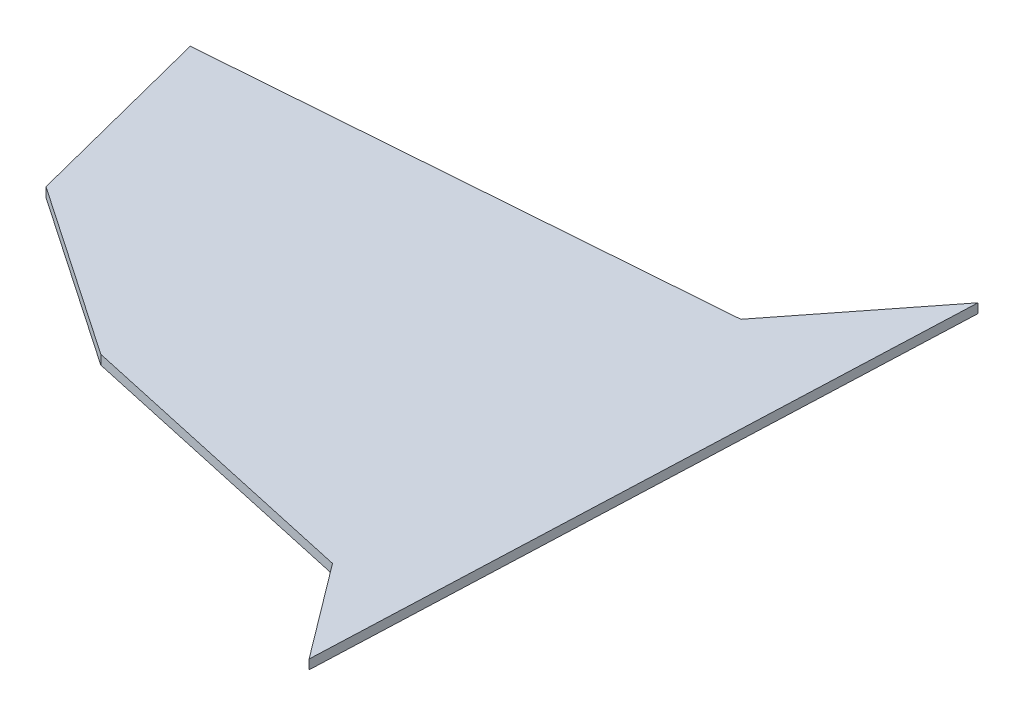
ISO-10303-21;
HEADER;
FILE_DESCRIPTION(('STEP AP214'),'2;1');
FILE_NAME('part.step','',(''),(''),'','','');
FILE_SCHEMA(('AUTOMOTIVE_DESIGN { 1 0 10303 214 1 1 1 1 }'));
ENDSEC;
DATA;
#1=APPLICATION_CONTEXT('core data for automotive mechanical design processes');
#2=APPLICATION_PROTOCOL_DEFINITION('international standard','automotive_design',2000,#1);
#3=PRODUCT_CONTEXT('',#1,'mechanical');
#4=PRODUCT('Part','Part','',(#3));
#5=PRODUCT_RELATED_PRODUCT_CATEGORY('part','',(#4));
#6=PRODUCT_DEFINITION_FORMATION('','',#4);
#7=PRODUCT_DEFINITION_CONTEXT('part definition',#1,'design');
#8=PRODUCT_DEFINITION('design','',#6,#7);
#9=PRODUCT_DEFINITION_SHAPE('','',#8);
#10=(LENGTH_UNIT() NAMED_UNIT(*) SI_UNIT(.MILLI.,.METRE.));
#11=(NAMED_UNIT(*) PLANE_ANGLE_UNIT() SI_UNIT($,.RADIAN.));
#12=(NAMED_UNIT(*) SI_UNIT($,.STERADIAN.) SOLID_ANGLE_UNIT());
#13=UNCERTAINTY_MEASURE_WITH_UNIT(LENGTH_MEASURE(1.E-05),#10,'distance_accuracy_value','');
#14=(GEOMETRIC_REPRESENTATION_CONTEXT(3) GLOBAL_UNCERTAINTY_ASSIGNED_CONTEXT((#13)) GLOBAL_UNIT_ASSIGNED_CONTEXT((#10,
#11,#12)) REPRESENTATION_CONTEXT('',''));
#15=CARTESIAN_POINT('',(0.,0.,0.));
#16=DIRECTION('',(0.,0.,1.));
#17=DIRECTION('',(1.,0.,0.));
#18=AXIS2_PLACEMENT_3D('',#15,#16,#17);
#19=CARTESIAN_POINT('',(115.204742489749,2.,59.1333729022609));
#20=DIRECTION('',(-0.999185842205052,0.,-0.0403441784769609));
#21=DIRECTION('',(-0.0403441784769609,0.,0.999185842205052));
#22=AXIS2_PLACEMENT_3D('',#19,#20,#21);
#23=PLANE('',#22);
#24=DIRECTION('',(0.0403441784769609,0.,-0.999185842205052));
#25=VECTOR('',#24,1.);
#26=CARTESIAN_POINT('',(115.204742489749,0.,59.1333729022609));
#27=LINE('',#26,#25);
#28=CARTESIAN_POINT('',(115.204742489749,0.,59.1333729022609));
#29=VERTEX_POINT('',#28);
#30=CARTESIAN_POINT('',(120.737356272689,0.,-77.8903457851641));
#31=VERTEX_POINT('',#30);
#32=EDGE_CURVE('E134',#29,#31,#27,.T.);
#33=ORIENTED_EDGE('',*,*,#32,.T.);
#34=DIRECTION('',(0.,-1.,0.));
#35=VECTOR('',#34,1.);
#36=CARTESIAN_POINT('',(120.737356272689,2.,-77.8903457851641));
#37=LINE('',#36,#35);
#38=CARTESIAN_POINT('',(120.737356272689,2.,-77.8903457851641));
#39=VERTEX_POINT('',#38);
#40=EDGE_CURVE('E11',#39,#31,#37,.T.);
#41=ORIENTED_EDGE('',*,*,#40,.F.);
#42=DIRECTION('',(0.0403441784769609,0.,-0.999185842205052));
#43=VECTOR('',#42,1.);
#44=CARTESIAN_POINT('',(115.204742489749,2.,59.1333729022609));
#45=LINE('',#44,#43);
#46=CARTESIAN_POINT('',(115.204742489749,2.,59.1333729022609));
#47=VERTEX_POINT('',#46);
#48=EDGE_CURVE('E153',#47,#39,#45,.T.);
#49=ORIENTED_EDGE('',*,*,#48,.F.);
#50=DIRECTION('',(0.,-1.,0.));
#51=VECTOR('',#50,1.);
#52=CARTESIAN_POINT('',(115.204742489749,2.,59.1333729022609));
#53=LINE('',#52,#51);
#54=EDGE_CURVE('E130',#47,#29,#53,.T.);
#55=ORIENTED_EDGE('',*,*,#54,.T.);
#56=EDGE_LOOP('',(#33,#41,#49,#55));
#57=FACE_BOUND('',#56,.T.);
#58=ADVANCED_FACE('F39',(#57),#23,.F.);
#59=CARTESIAN_POINT('',(120.737356272689,2.,-77.8903457851641));
#60=DIRECTION('',(0.786634461049331,0.,0.617419002533634));
#61=DIRECTION('',(0.617419002533634,0.,-0.786634461049331));
#62=AXIS2_PLACEMENT_3D('',#59,#60,#61);
#63=PLANE('',#62);
#64=DIRECTION('',(-0.617419002533634,0.,0.786634461049331));
#65=VECTOR('',#64,1.);
#66=CARTESIAN_POINT('',(120.737356272689,0.,-77.8903457851641));
#67=LINE('',#66,#65);
#68=CARTESIAN_POINT('',(98.5111559376508,0.,-49.5726311538025));
#69=VERTEX_POINT('',#68);
#70=EDGE_CURVE('E138',#31,#69,#67,.T.);
#71=ORIENTED_EDGE('',*,*,#70,.T.);
#72=DIRECTION('',(0.,-1.,0.));
#73=VECTOR('',#72,1.);
#74=CARTESIAN_POINT('',(98.5111559376508,2.,-49.5726311538025));
#75=LINE('',#74,#73);
#76=CARTESIAN_POINT('',(98.5111559376508,2.,-49.5726311538025));
#77=VERTEX_POINT('',#76);
#78=EDGE_CURVE('E48',#77,#69,#75,.T.);
#79=ORIENTED_EDGE('',*,*,#78,.F.);
#80=DIRECTION('',(-0.617419002533634,0.,0.786634461049331));
#81=VECTOR('',#80,1.);
#82=CARTESIAN_POINT('',(120.737356272689,2.,-77.8903457851641));
#83=LINE('',#82,#81);
#84=EDGE_CURVE('E96',#39,#77,#83,.T.);
#85=ORIENTED_EDGE('',*,*,#84,.F.);
#86=ORIENTED_EDGE('',*,*,#40,.T.);
#87=EDGE_LOOP('',(#71,#79,#85,#86));
#88=FACE_BOUND('',#87,.T.);
#89=ADVANCED_FACE('F187',(#88),#63,.F.);
#90=CARTESIAN_POINT('',(98.5111559376508,2.,-49.5726311538025));
#91=DIRECTION('',(0.0755543985712088,0.,0.997141681435764));
#92=DIRECTION('',(0.997141681435764,0.,-0.0755543985712088));
#93=AXIS2_PLACEMENT_3D('',#90,#91,#92);
#94=PLANE('',#93);
#95=DIRECTION('',(-0.997141681435764,0.,0.0755543985712088));
#96=VECTOR('',#95,1.);
#97=CARTESIAN_POINT('',(98.5111559376508,0.,-49.5726311538025));
#98=LINE('',#97,#96);
#99=CARTESIAN_POINT('',(-10.5666550321741,0.,-41.3076989393326));
#100=VERTEX_POINT('',#99);
#101=EDGE_CURVE('E141',#69,#100,#98,.T.);
#102=ORIENTED_EDGE('',*,*,#101,.T.);
#103=DIRECTION('',(0.,-1.,0.));
#104=VECTOR('',#103,1.);
#105=CARTESIAN_POINT('',(-10.5666550321741,2.,-41.3076989393326));
#106=LINE('',#105,#104);
#107=CARTESIAN_POINT('',(-10.5666550321741,2.,-41.3076989393326));
#108=VERTEX_POINT('',#107);
#109=EDGE_CURVE('E160',#108,#100,#106,.T.);
#110=ORIENTED_EDGE('',*,*,#109,.F.);
#111=DIRECTION('',(-0.997141681435764,0.,0.0755543985712088));
#112=VECTOR('',#111,1.);
#113=CARTESIAN_POINT('',(98.5111559376508,2.,-49.5726311538025));
#114=LINE('',#113,#112);
#115=EDGE_CURVE('E170',#77,#108,#114,.T.);
#116=ORIENTED_EDGE('',*,*,#115,.F.);
#117=ORIENTED_EDGE('',*,*,#78,.T.);
#118=EDGE_LOOP('',(#102,#110,#116,#117));
#119=FACE_BOUND('',#118,.T.);
#120=ADVANCED_FACE('F168',(#119),#94,.F.);
#121=CARTESIAN_POINT('',(-10.5666550321741,2.,-41.3076989393326));
#122=DIRECTION('',(0.968805130027758,0.,-0.247823768093175));
#123=DIRECTION('',(-0.247823768093175,0.,-0.968805130027758));
#124=AXIS2_PLACEMENT_3D('',#121,#122,#123);
#125=PLANE('',#124);
#126=DIRECTION('',(0.247823768093175,0.,0.968805130027757));
#127=VECTOR('',#126,1.);
#128=CARTESIAN_POINT('',(-10.5666550321741,0.,-41.3076989393326));
#129=LINE('',#128,#127);
#130=CARTESIAN_POINT('',(0.,0.,0.));
#131=VERTEX_POINT('',#130);
#132=EDGE_CURVE('E144',#100,#131,#129,.T.);
#133=ORIENTED_EDGE('',*,*,#132,.T.);
#134=DIRECTION('',(0.,-1.,0.));
#135=VECTOR('',#134,1.);
#136=CARTESIAN_POINT('',(0.,2.,0.));
#137=LINE('',#136,#135);
#138=CARTESIAN_POINT('',(0.,2.,0.));
#139=VERTEX_POINT('',#138);
#140=EDGE_CURVE('E123',#139,#131,#137,.T.);
#141=ORIENTED_EDGE('',*,*,#140,.F.);
#142=DIRECTION('',(0.247823768093175,0.,0.968805130027757));
#143=VECTOR('',#142,1.);
#144=CARTESIAN_POINT('',(-10.5666550321741,2.,-41.3076989393326));
#145=LINE('',#144,#143);
#146=EDGE_CURVE('E112',#108,#139,#145,.T.);
#147=ORIENTED_EDGE('',*,*,#146,.F.);
#148=ORIENTED_EDGE('',*,*,#109,.T.);
#149=EDGE_LOOP('',(#133,#141,#147,#148));
#150=FACE_BOUND('',#149,.T.);
#151=ADVANCED_FACE('F176',(#150),#125,.F.);
#152=CARTESIAN_POINT('',(0.,2.,0.));
#153=DIRECTION('',(0.563659395525079,0.,-0.826007315849141));
#154=DIRECTION('',(-0.826007315849141,0.,-0.563659395525079));
#155=AXIS2_PLACEMENT_3D('',#152,#153,#154);
#156=PLANE('',#155);
#157=DIRECTION('',(0.826007315849141,0.,0.563659395525079));
#158=VECTOR('',#157,1.);
#159=CARTESIAN_POINT('',(0.,0.,0.));
#160=LINE('',#159,#158);
#161=CARTESIAN_POINT('',(36.7641746147648,0.,25.0875168327461));
#162=VERTEX_POINT('',#161);
#163=EDGE_CURVE('E121',#131,#162,#160,.T.);
#164=ORIENTED_EDGE('',*,*,#163,.T.);
#165=DIRECTION('',(0.,-1.,0.));
#166=VECTOR('',#165,1.);
#167=CARTESIAN_POINT('',(36.7641746147648,2.,25.0875168327461));
#168=LINE('',#167,#166);
#169=CARTESIAN_POINT('',(36.7641746147648,2.,25.0875168327461));
#170=VERTEX_POINT('',#169);
#171=EDGE_CURVE('E118',#170,#162,#168,.T.);
#172=ORIENTED_EDGE('',*,*,#171,.F.);
#173=DIRECTION('',(0.826007315849141,0.,0.563659395525079));
#174=VECTOR('',#173,1.);
#175=CARTESIAN_POINT('',(0.,2.,0.));
#176=LINE('',#175,#174);
#177=EDGE_CURVE('E106',#139,#170,#176,.T.);
#178=ORIENTED_EDGE('',*,*,#177,.F.);
#179=ORIENTED_EDGE('',*,*,#140,.T.);
#180=EDGE_LOOP('',(#164,#172,#178,#179));
#181=FACE_BOUND('',#180,.T.);
#182=ADVANCED_FACE('F119',(#181),#156,.F.);
#183=CARTESIAN_POINT('',(36.7641746147648,2.,25.0875168327461));
#184=DIRECTION('',(0.214636441955826,0.,-0.976694014410114));
#185=DIRECTION('',(-0.976694014410114,0.,-0.214636441955826));
#186=AXIS2_PLACEMENT_3D('',#183,#184,#185);
#187=PLANE('',#186);
#188=DIRECTION('',(0.976694014410114,0.,0.214636441955826));
#189=VECTOR('',#188,1.);
#190=CARTESIAN_POINT('',(36.7641746147648,0.,25.0875168327461));
#191=LINE('',#190,#189);
#192=CARTESIAN_POINT('',(100.061690001012,0.,38.9976599141016));
#193=VERTEX_POINT('',#192);
#194=EDGE_CURVE('E82',#162,#193,#191,.T.);
#195=ORIENTED_EDGE('',*,*,#194,.T.);
#196=DIRECTION('',(0.,-1.,0.));
#197=VECTOR('',#196,1.);
#198=CARTESIAN_POINT('',(100.061690001012,2.,38.9976599141016));
#199=LINE('',#198,#197);
#200=CARTESIAN_POINT('',(100.061690001012,2.,38.9976599141016));
#201=VERTEX_POINT('',#200);
#202=EDGE_CURVE('E124',#201,#193,#199,.T.);
#203=ORIENTED_EDGE('',*,*,#202,.F.);
#204=DIRECTION('',(0.976694014410114,0.,0.214636441955826));
#205=VECTOR('',#204,1.);
#206=CARTESIAN_POINT('',(36.7641746147648,2.,25.0875168327461));
#207=LINE('',#206,#205);
#208=EDGE_CURVE('E110',#170,#201,#207,.T.);
#209=ORIENTED_EDGE('',*,*,#208,.F.);
#210=ORIENTED_EDGE('',*,*,#171,.T.);
#211=EDGE_LOOP('',(#195,#203,#209,#210));
#212=FACE_BOUND('',#211,.T.);
#213=ADVANCED_FACE('F126',(#212),#187,.F.);
#214=CARTESIAN_POINT('',(100.061690001012,2.,38.9976599141016));
#215=DIRECTION('',(0.799213086845441,0.,-0.601047786631797));
#216=DIRECTION('',(-0.601047786631797,0.,-0.79921308684544));
#217=AXIS2_PLACEMENT_3D('',#214,#215,#216);
#218=PLANE('',#217);
#219=DIRECTION('',(0.601047786631797,0.,0.79921308684544));
#220=VECTOR('',#219,1.);
#221=CARTESIAN_POINT('',(100.061690001012,0.,38.9976599141016));
#222=LINE('',#221,#220);
#223=EDGE_CURVE('E88',#193,#29,#222,.T.);
#224=ORIENTED_EDGE('',*,*,#223,.T.);
#225=ORIENTED_EDGE('',*,*,#54,.F.);
#226=DIRECTION('',(0.601047786631797,0.,0.79921308684544));
#227=VECTOR('',#226,1.);
#228=CARTESIAN_POINT('',(100.061690001012,2.,38.9976599141016));
#229=LINE('',#228,#227);
#230=EDGE_CURVE('E56',#201,#47,#229,.T.);
#231=ORIENTED_EDGE('',*,*,#230,.F.);
#232=ORIENTED_EDGE('',*,*,#202,.T.);
#233=EDGE_LOOP('',(#224,#225,#231,#232));
#234=FACE_BOUND('',#233,.T.);
#235=ADVANCED_FACE('F201',(#234),#218,.F.);
#236=CARTESIAN_POINT('',(0.,2.,0.));
#237=DIRECTION('',(0.,1.,0.));
#238=DIRECTION('',(0.,0.,1.));
#239=AXIS2_PLACEMENT_3D('',#236,#237,#238);
#240=PLANE('',#239);
#241=ORIENTED_EDGE('',*,*,#48,.T.);
#242=ORIENTED_EDGE('',*,*,#84,.T.);
#243=ORIENTED_EDGE('',*,*,#115,.T.);
#244=ORIENTED_EDGE('',*,*,#146,.T.);
#245=ORIENTED_EDGE('',*,*,#177,.T.);
#246=ORIENTED_EDGE('',*,*,#208,.T.);
#247=ORIENTED_EDGE('',*,*,#230,.T.);
#248=EDGE_LOOP('',(#241,#242,#243,#244,#245,#246,#247));
#249=FACE_BOUND('',#248,.T.);
#250=ADVANCED_FACE('F108',(#249),#240,.T.);
#251=CARTESIAN_POINT('',(0.,0.,0.));
#252=DIRECTION('',(0.,1.,0.));
#253=DIRECTION('',(0.,0.,1.));
#254=AXIS2_PLACEMENT_3D('',#251,#252,#253);
#255=PLANE('',#254);
#256=ORIENTED_EDGE('',*,*,#32,.F.);
#257=ORIENTED_EDGE('',*,*,#223,.F.);
#258=ORIENTED_EDGE('',*,*,#194,.F.);
#259=ORIENTED_EDGE('',*,*,#163,.F.);
#260=ORIENTED_EDGE('',*,*,#132,.F.);
#261=ORIENTED_EDGE('',*,*,#101,.F.);
#262=ORIENTED_EDGE('',*,*,#70,.F.);
#263=EDGE_LOOP('',(#256,#257,#258,#259,#260,#261,#262));
#264=FACE_BOUND('',#263,.T.);
#265=ADVANCED_FACE('F174',(#264),#255,.F.);
#266=CLOSED_SHELL('',(#58,#89,#120,#151,#182,#213,#235,#250,#265));
#267=MANIFOLD_SOLID_BREP('B2',#266);
#268=ADVANCED_BREP_SHAPE_REPRESENTATION('',(#18,#267),#14);
#269=SHAPE_DEFINITION_REPRESENTATION(#9,#268);
ENDSEC;
END-ISO-10303-21;
